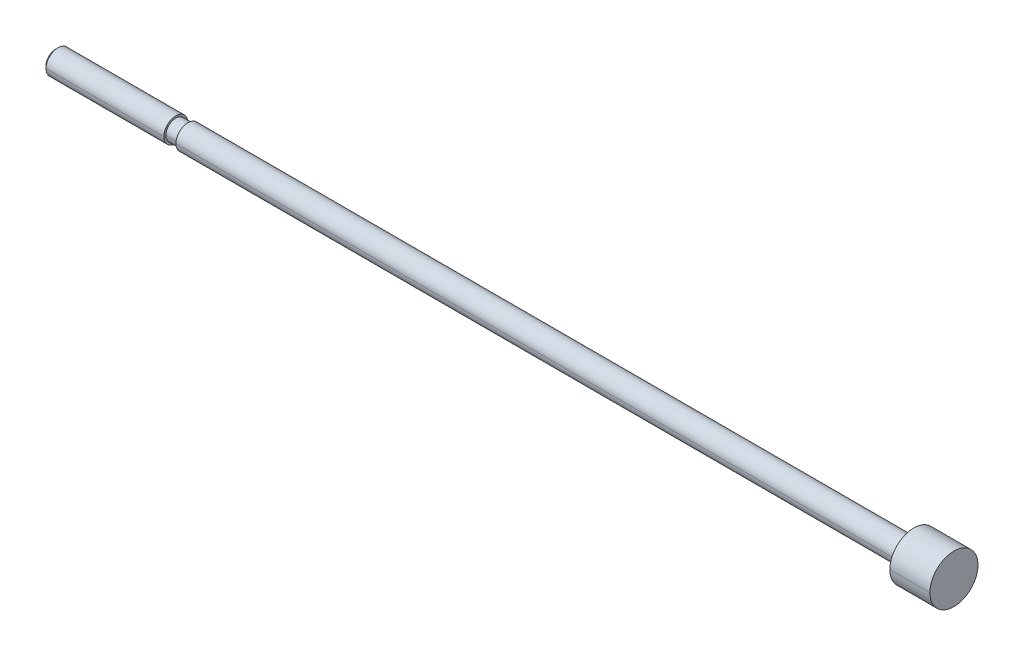
ISO-10303-21;
HEADER;
FILE_DESCRIPTION(('STEP AP214'),'2;1');
FILE_NAME('part.step','',(''),(''),'','','');
FILE_SCHEMA(('AUTOMOTIVE_DESIGN { 1 0 10303 214 1 1 1 1 }'));
ENDSEC;
DATA;
#1=APPLICATION_CONTEXT('core data for automotive mechanical design processes');
#2=APPLICATION_PROTOCOL_DEFINITION('international standard','automotive_design',2000,#1);
#3=PRODUCT_CONTEXT('',#1,'mechanical');
#4=PRODUCT('Part','Part','',(#3));
#5=PRODUCT_RELATED_PRODUCT_CATEGORY('part','',(#4));
#6=PRODUCT_DEFINITION_FORMATION('','',#4);
#7=PRODUCT_DEFINITION_CONTEXT('part definition',#1,'design');
#8=PRODUCT_DEFINITION('design','',#6,#7);
#9=PRODUCT_DEFINITION_SHAPE('','',#8);
#10=(LENGTH_UNIT() NAMED_UNIT(*) SI_UNIT(.MILLI.,.METRE.));
#11=(NAMED_UNIT(*) PLANE_ANGLE_UNIT() SI_UNIT($,.RADIAN.));
#12=(NAMED_UNIT(*) SI_UNIT($,.STERADIAN.) SOLID_ANGLE_UNIT());
#13=UNCERTAINTY_MEASURE_WITH_UNIT(LENGTH_MEASURE(1.E-05),#10,'distance_accuracy_value','');
#14=(GEOMETRIC_REPRESENTATION_CONTEXT(3) GLOBAL_UNCERTAINTY_ASSIGNED_CONTEXT((#13)) GLOBAL_UNIT_ASSIGNED_CONTEXT((#10,
#11,#12)) REPRESENTATION_CONTEXT('',''));
#15=CARTESIAN_POINT('',(0.,0.,0.));
#16=DIRECTION('',(0.,0.,1.));
#17=DIRECTION('',(1.,0.,0.));
#18=AXIS2_PLACEMENT_3D('',#15,#16,#17);
#19=CARTESIAN_POINT('',(112.,0.,0.));
#20=DIRECTION('',(-1.,0.,0.));
#21=DIRECTION('',(0.,-1.,0.));
#22=AXIS2_PLACEMENT_3D('',#19,#20,#21);
#23=CYLINDRICAL_SURFACE('',#22,3.);
#24=CARTESIAN_POINT('',(112.,0.,0.));
#25=DIRECTION('',(1.,0.,0.));
#26=DIRECTION('',(0.,0.,-1.));
#27=AXIS2_PLACEMENT_3D('',#24,#25,#26);
#28=CIRCLE('',#27,3.);
#29=CARTESIAN_POINT('',(112.,0.,-3.));
#30=VERTEX_POINT('',#29);
#31=CARTESIAN_POINT('',(112.,0.,3.));
#32=VERTEX_POINT('',#31);
#33=EDGE_CURVE('E11',#30,#32,#28,.T.);
#34=ORIENTED_EDGE('',*,*,#33,.F.);
#35=DIRECTION('',(-1.,0.,0.));
#36=VECTOR('',#35,1.);
#37=CARTESIAN_POINT('',(112.,0.,-3.));
#38=LINE('',#37,#36);
#39=CARTESIAN_POINT('',(107.,0.,-3.));
#40=VERTEX_POINT('',#39);
#41=EDGE_CURVE('E25',#30,#40,#38,.T.);
#42=ORIENTED_EDGE('',*,*,#41,.T.);
#43=CARTESIAN_POINT('',(107.,0.,0.));
#44=DIRECTION('',(1.,0.,0.));
#45=DIRECTION('',(0.,0.,-1.));
#46=AXIS2_PLACEMENT_3D('',#43,#44,#45);
#47=CIRCLE('',#46,3.);
#48=CARTESIAN_POINT('',(107.,0.,3.));
#49=VERTEX_POINT('',#48);
#50=EDGE_CURVE('E201',#40,#49,#47,.T.);
#51=ORIENTED_EDGE('',*,*,#50,.T.);
#52=DIRECTION('',(-1.,0.,0.));
#53=VECTOR('',#52,1.);
#54=CARTESIAN_POINT('',(112.,0.,3.));
#55=LINE('',#54,#53);
#56=EDGE_CURVE('E196',#32,#49,#55,.T.);
#57=ORIENTED_EDGE('',*,*,#56,.F.);
#58=EDGE_LOOP('',(#34,#42,#51,#57));
#59=FACE_BOUND('',#58,.T.);
#60=ADVANCED_FACE('F17',(#59),#23,.T.);
#61=CARTESIAN_POINT('',(112.,0.,0.));
#62=DIRECTION('',(-1.,0.,0.));
#63=DIRECTION('',(0.,1.,0.));
#64=AXIS2_PLACEMENT_3D('',#61,#62,#63);
#65=CYLINDRICAL_SURFACE('',#64,3.);
#66=CARTESIAN_POINT('',(107.,0.,0.));
#67=DIRECTION('',(1.,0.,0.));
#68=DIRECTION('',(0.,0.,-1.));
#69=AXIS2_PLACEMENT_3D('',#66,#67,#68);
#70=CIRCLE('',#69,3.);
#71=EDGE_CURVE('E192',#49,#40,#70,.T.);
#72=ORIENTED_EDGE('',*,*,#71,.T.);
#73=ORIENTED_EDGE('',*,*,#41,.F.);
#74=CARTESIAN_POINT('',(112.,0.,0.));
#75=DIRECTION('',(1.,0.,0.));
#76=DIRECTION('',(0.,0.,-1.));
#77=AXIS2_PLACEMENT_3D('',#74,#75,#76);
#78=CIRCLE('',#77,3.);
#79=EDGE_CURVE('E187',#32,#30,#78,.T.);
#80=ORIENTED_EDGE('',*,*,#79,.F.);
#81=ORIENTED_EDGE('',*,*,#56,.T.);
#82=EDGE_LOOP('',(#72,#73,#80,#81));
#83=FACE_BOUND('',#82,.T.);
#84=ADVANCED_FACE('F214',(#83),#65,.T.);
#85=CARTESIAN_POINT('',(112.,3.,0.));
#86=DIRECTION('',(-1.,0.,0.));
#87=DIRECTION('',(0.,0.,1.));
#88=AXIS2_PLACEMENT_3D('',#85,#86,#87);
#89=PLANE('',#88);
#90=ORIENTED_EDGE('',*,*,#33,.T.);
#91=ORIENTED_EDGE('',*,*,#79,.T.);
#92=EDGE_LOOP('',(#90,#91));
#93=FACE_BOUND('',#92,.T.);
#94=ADVANCED_FACE('F219',(#93),#89,.F.);
#95=CARTESIAN_POINT('',(107.,1.5,0.));
#96=DIRECTION('',(1.,0.,0.));
#97=DIRECTION('',(0.,0.,-1.));
#98=AXIS2_PLACEMENT_3D('',#95,#96,#97);
#99=PLANE('',#98);
#100=ORIENTED_EDGE('',*,*,#50,.F.);
#101=ORIENTED_EDGE('',*,*,#71,.F.);
#102=EDGE_LOOP('',(#100,#101));
#103=FACE_BOUND('',#102,.T.);
#104=CARTESIAN_POINT('',(107.,0.,0.));
#105=DIRECTION('',(1.,0.,0.));
#106=DIRECTION('',(0.,0.,-1.));
#107=AXIS2_PLACEMENT_3D('',#104,#105,#106);
#108=CIRCLE('',#107,1.5);
#109=CARTESIAN_POINT('',(107.,0.,-1.5));
#110=VERTEX_POINT('',#109);
#111=CARTESIAN_POINT('',(107.,0.,1.5));
#112=VERTEX_POINT('',#111);
#113=EDGE_CURVE('E183',#110,#112,#108,.T.);
#114=ORIENTED_EDGE('',*,*,#113,.T.);
#115=CARTESIAN_POINT('',(107.,0.,0.));
#116=DIRECTION('',(1.,0.,0.));
#117=DIRECTION('',(0.,0.,-1.));
#118=AXIS2_PLACEMENT_3D('',#115,#116,#117);
#119=CIRCLE('',#118,1.5);
#120=EDGE_CURVE('E179',#112,#110,#119,.T.);
#121=ORIENTED_EDGE('',*,*,#120,.T.);
#122=EDGE_LOOP('',(#114,#121));
#123=FACE_BOUND('',#122,.T.);
#124=ADVANCED_FACE('F215',(#103,#123),#99,.F.);
#125=CARTESIAN_POINT('',(112.,0.,0.));
#126=DIRECTION('',(-1.,0.,0.));
#127=DIRECTION('',(0.,1.,0.));
#128=AXIS2_PLACEMENT_3D('',#125,#126,#127);
#129=CYLINDRICAL_SURFACE('',#128,1.5);
#130=CARTESIAN_POINT('',(16.5,0.,0.));
#131=DIRECTION('',(1.,0.,0.));
#132=DIRECTION('',(0.,0.,-1.));
#133=AXIS2_PLACEMENT_3D('',#130,#131,#132);
#134=CIRCLE('',#133,1.5);
#135=CARTESIAN_POINT('',(16.5,0.,1.5));
#136=VERTEX_POINT('',#135);
#137=CARTESIAN_POINT('',(16.5,0.,-1.5));
#138=VERTEX_POINT('',#137);
#139=EDGE_CURVE('E175',#136,#138,#134,.T.);
#140=ORIENTED_EDGE('',*,*,#139,.T.);
#141=DIRECTION('',(-1.,0.,0.));
#142=VECTOR('',#141,1.);
#143=CARTESIAN_POINT('',(107.,0.,-1.5));
#144=LINE('',#143,#142);
#145=EDGE_CURVE('E170',#110,#138,#144,.T.);
#146=ORIENTED_EDGE('',*,*,#145,.F.);
#147=ORIENTED_EDGE('',*,*,#120,.F.);
#148=DIRECTION('',(-1.,0.,0.));
#149=VECTOR('',#148,1.);
#150=CARTESIAN_POINT('',(107.,0.,1.5));
#151=LINE('',#150,#149);
#152=EDGE_CURVE('E166',#112,#136,#151,.T.);
#153=ORIENTED_EDGE('',*,*,#152,.T.);
#154=EDGE_LOOP('',(#140,#146,#147,#153));
#155=FACE_BOUND('',#154,.T.);
#156=ADVANCED_FACE('F218',(#155),#129,.T.);
#157=CARTESIAN_POINT('',(112.,0.,0.));
#158=DIRECTION('',(-1.,0.,0.));
#159=DIRECTION('',(0.,-1.,0.));
#160=AXIS2_PLACEMENT_3D('',#157,#158,#159);
#161=CYLINDRICAL_SURFACE('',#160,1.5);
#162=ORIENTED_EDGE('',*,*,#113,.F.);
#163=ORIENTED_EDGE('',*,*,#145,.T.);
#164=CARTESIAN_POINT('',(16.5,0.,0.));
#165=DIRECTION('',(1.,0.,0.));
#166=DIRECTION('',(0.,0.,-1.));
#167=AXIS2_PLACEMENT_3D('',#164,#165,#166);
#168=CIRCLE('',#167,1.5);
#169=EDGE_CURVE('E161',#138,#136,#168,.T.);
#170=ORIENTED_EDGE('',*,*,#169,.T.);
#171=ORIENTED_EDGE('',*,*,#152,.F.);
#172=EDGE_LOOP('',(#162,#163,#170,#171));
#173=FACE_BOUND('',#172,.T.);
#174=ADVANCED_FACE('F227',(#173),#161,.T.);
#175=CARTESIAN_POINT('',(16.5,1.25,0.));
#176=DIRECTION('',(1.,0.,0.));
#177=DIRECTION('',(0.,0.,-1.));
#178=AXIS2_PLACEMENT_3D('',#175,#176,#177);
#179=PLANE('',#178);
#180=ORIENTED_EDGE('',*,*,#169,.F.);
#181=ORIENTED_EDGE('',*,*,#139,.F.);
#182=EDGE_LOOP('',(#180,#181));
#183=FACE_BOUND('',#182,.T.);
#184=CARTESIAN_POINT('',(16.5,0.,0.));
#185=DIRECTION('',(1.,0.,0.));
#186=DIRECTION('',(0.,0.,-1.));
#187=AXIS2_PLACEMENT_3D('',#184,#185,#186);
#188=CIRCLE('',#187,1.25);
#189=CARTESIAN_POINT('',(16.5,0.,-1.25));
#190=VERTEX_POINT('',#189);
#191=CARTESIAN_POINT('',(16.5,0.,1.25));
#192=VERTEX_POINT('',#191);
#193=EDGE_CURVE('E157',#190,#192,#188,.T.);
#194=ORIENTED_EDGE('',*,*,#193,.T.);
#195=CARTESIAN_POINT('',(16.5,0.,0.));
#196=DIRECTION('',(1.,0.,0.));
#197=DIRECTION('',(0.,0.,-1.));
#198=AXIS2_PLACEMENT_3D('',#195,#196,#197);
#199=CIRCLE('',#198,1.25);
#200=EDGE_CURVE('E153',#192,#190,#199,.T.);
#201=ORIENTED_EDGE('',*,*,#200,.T.);
#202=EDGE_LOOP('',(#194,#201));
#203=FACE_BOUND('',#202,.T.);
#204=ADVANCED_FACE('F231',(#183,#203),#179,.F.);
#205=CARTESIAN_POINT('',(112.,0.,0.));
#206=DIRECTION('',(-1.,0.,0.));
#207=DIRECTION('',(0.,1.,0.));
#208=AXIS2_PLACEMENT_3D('',#205,#206,#207);
#209=CYLINDRICAL_SURFACE('',#208,1.25);
#210=CARTESIAN_POINT('',(15.,0.,0.));
#211=DIRECTION('',(1.,0.,0.));
#212=DIRECTION('',(0.,0.,-1.));
#213=AXIS2_PLACEMENT_3D('',#210,#211,#212);
#214=CIRCLE('',#213,1.25);
#215=CARTESIAN_POINT('',(15.,0.,1.25));
#216=VERTEX_POINT('',#215);
#217=CARTESIAN_POINT('',(15.,0.,-1.25));
#218=VERTEX_POINT('',#217);
#219=EDGE_CURVE('E149',#216,#218,#214,.T.);
#220=ORIENTED_EDGE('',*,*,#219,.T.);
#221=DIRECTION('',(-1.,0.,0.));
#222=VECTOR('',#221,1.);
#223=CARTESIAN_POINT('',(16.5,0.,-1.25));
#224=LINE('',#223,#222);
#225=EDGE_CURVE('E144',#190,#218,#224,.T.);
#226=ORIENTED_EDGE('',*,*,#225,.F.);
#227=ORIENTED_EDGE('',*,*,#200,.F.);
#228=DIRECTION('',(-1.,0.,0.));
#229=VECTOR('',#228,1.);
#230=CARTESIAN_POINT('',(16.5,0.,1.25));
#231=LINE('',#230,#229);
#232=EDGE_CURVE('E140',#192,#216,#231,.T.);
#233=ORIENTED_EDGE('',*,*,#232,.T.);
#234=EDGE_LOOP('',(#220,#226,#227,#233));
#235=FACE_BOUND('',#234,.T.);
#236=ADVANCED_FACE('F234',(#235),#209,.T.);
#237=CARTESIAN_POINT('',(112.,0.,0.));
#238=DIRECTION('',(-1.,0.,0.));
#239=DIRECTION('',(0.,-1.,0.));
#240=AXIS2_PLACEMENT_3D('',#237,#238,#239);
#241=CYLINDRICAL_SURFACE('',#240,1.25);
#242=ORIENTED_EDGE('',*,*,#193,.F.);
#243=ORIENTED_EDGE('',*,*,#225,.T.);
#244=CARTESIAN_POINT('',(15.,0.,0.));
#245=DIRECTION('',(1.,0.,0.));
#246=DIRECTION('',(0.,0.,-1.));
#247=AXIS2_PLACEMENT_3D('',#244,#245,#246);
#248=CIRCLE('',#247,1.25);
#249=EDGE_CURVE('E135',#218,#216,#248,.T.);
#250=ORIENTED_EDGE('',*,*,#249,.T.);
#251=ORIENTED_EDGE('',*,*,#232,.F.);
#252=EDGE_LOOP('',(#242,#243,#250,#251));
#253=FACE_BOUND('',#252,.T.);
#254=ADVANCED_FACE('F242',(#253),#241,.T.);
#255=CARTESIAN_POINT('',(15.,1.5,0.));
#256=DIRECTION('',(-1.,0.,0.));
#257=DIRECTION('',(0.,0.,1.));
#258=AXIS2_PLACEMENT_3D('',#255,#256,#257);
#259=PLANE('',#258);
#260=ORIENTED_EDGE('',*,*,#249,.F.);
#261=ORIENTED_EDGE('',*,*,#219,.F.);
#262=EDGE_LOOP('',(#260,#261));
#263=FACE_BOUND('',#262,.T.);
#264=CARTESIAN_POINT('',(15.,0.,0.));
#265=DIRECTION('',(1.,0.,0.));
#266=DIRECTION('',(0.,0.,-1.));
#267=AXIS2_PLACEMENT_3D('',#264,#265,#266);
#268=CIRCLE('',#267,1.5);
#269=CARTESIAN_POINT('',(15.,0.,-1.5));
#270=VERTEX_POINT('',#269);
#271=CARTESIAN_POINT('',(15.,0.,1.5));
#272=VERTEX_POINT('',#271);
#273=EDGE_CURVE('E131',#270,#272,#268,.T.);
#274=ORIENTED_EDGE('',*,*,#273,.T.);
#275=CARTESIAN_POINT('',(15.,0.,0.));
#276=DIRECTION('',(1.,0.,0.));
#277=DIRECTION('',(0.,0.,-1.));
#278=AXIS2_PLACEMENT_3D('',#275,#276,#277);
#279=CIRCLE('',#278,1.5);
#280=EDGE_CURVE('E127',#272,#270,#279,.T.);
#281=ORIENTED_EDGE('',*,*,#280,.T.);
#282=EDGE_LOOP('',(#274,#281));
#283=FACE_BOUND('',#282,.T.);
#284=ADVANCED_FACE('F246',(#263,#283),#259,.F.);
#285=CARTESIAN_POINT('',(112.,0.,0.));
#286=DIRECTION('',(-1.,0.,0.));
#287=DIRECTION('',(0.,1.,0.));
#288=AXIS2_PLACEMENT_3D('',#285,#286,#287);
#289=CYLINDRICAL_SURFACE('',#288,1.5);
#290=CARTESIAN_POINT('',(0.306500000000001,0.,0.));
#291=DIRECTION('',(1.,0.,0.));
#292=DIRECTION('',(0.,0.,-1.));
#293=AXIS2_PLACEMENT_3D('',#290,#291,#292);
#294=CIRCLE('',#293,1.5);
#295=CARTESIAN_POINT('',(0.3065,0.,1.5));
#296=VERTEX_POINT('',#295);
#297=CARTESIAN_POINT('',(0.306500000000001,0.,-1.5));
#298=VERTEX_POINT('',#297);
#299=EDGE_CURVE('E98',#296,#298,#294,.T.);
#300=ORIENTED_EDGE('',*,*,#299,.T.);
#301=DIRECTION('',(-1.,0.,0.));
#302=VECTOR('',#301,1.);
#303=CARTESIAN_POINT('',(15.,0.,-1.5));
#304=LINE('',#303,#302);
#305=EDGE_CURVE('E119',#270,#298,#304,.T.);
#306=ORIENTED_EDGE('',*,*,#305,.F.);
#307=ORIENTED_EDGE('',*,*,#280,.F.);
#308=DIRECTION('',(-1.,0.,0.));
#309=VECTOR('',#308,1.);
#310=CARTESIAN_POINT('',(15.,0.,1.5));
#311=LINE('',#310,#309);
#312=EDGE_CURVE('E115',#272,#296,#311,.T.);
#313=ORIENTED_EDGE('',*,*,#312,.T.);
#314=EDGE_LOOP('',(#300,#306,#307,#313));
#315=FACE_BOUND('',#314,.T.);
#316=ADVANCED_FACE('F249',(#315),#289,.T.);
#317=CARTESIAN_POINT('',(112.,0.,0.));
#318=DIRECTION('',(-1.,0.,0.));
#319=DIRECTION('',(0.,-1.,0.));
#320=AXIS2_PLACEMENT_3D('',#317,#318,#319);
#321=CYLINDRICAL_SURFACE('',#320,1.5);
#322=ORIENTED_EDGE('',*,*,#273,.F.);
#323=ORIENTED_EDGE('',*,*,#305,.T.);
#324=CARTESIAN_POINT('',(0.306500000000001,0.,0.));
#325=DIRECTION('',(1.,0.,0.));
#326=DIRECTION('',(0.,0.,-1.));
#327=AXIS2_PLACEMENT_3D('',#324,#325,#326);
#328=CIRCLE('',#327,1.5);
#329=EDGE_CURVE('E110',#298,#296,#328,.T.);
#330=ORIENTED_EDGE('',*,*,#329,.T.);
#331=ORIENTED_EDGE('',*,*,#312,.F.);
#332=EDGE_LOOP('',(#322,#323,#330,#331));
#333=FACE_BOUND('',#332,.T.);
#334=ADVANCED_FACE('F257',(#333),#321,.T.);
#335=CARTESIAN_POINT('',(0.,0.,0.));
#336=DIRECTION('',(1.,0.,0.));
#337=DIRECTION('',(0.,-1.,0.));
#338=AXIS2_PLACEMENT_3D('',#335,#336,#337);
#339=CONICAL_SURFACE('',#338,1.1935,0.7853981634);
#340=ORIENTED_EDGE('',*,*,#329,.F.);
#341=DIRECTION('',(0.707106781184743,0.,-0.707106781188352));
#342=VECTOR('',#341,1.);
#343=CARTESIAN_POINT('',(0.,0.,-1.1935));
#344=LINE('',#343,#342);
#345=CARTESIAN_POINT('',(0.,0.,-1.1935));
#346=VERTEX_POINT('',#345);
#347=EDGE_CURVE('E90',#346,#298,#344,.T.);
#348=ORIENTED_EDGE('',*,*,#347,.F.);
#349=CARTESIAN_POINT('',(0.,0.,0.));
#350=DIRECTION('',(1.,0.,0.));
#351=DIRECTION('',(0.,0.,-1.));
#352=AXIS2_PLACEMENT_3D('',#349,#350,#351);
#353=CIRCLE('',#352,1.1935);
#354=CARTESIAN_POINT('',(0.,0.,1.1935));
#355=VERTEX_POINT('',#354);
#356=EDGE_CURVE('E83',#346,#355,#353,.T.);
#357=ORIENTED_EDGE('',*,*,#356,.T.);
#358=DIRECTION('',(0.707106781184743,0.,0.707106781188352));
#359=VECTOR('',#358,1.);
#360=CARTESIAN_POINT('',(0.,0.,1.1935));
#361=LINE('',#360,#359);
#362=EDGE_CURVE('E87',#355,#296,#361,.T.);
#363=ORIENTED_EDGE('',*,*,#362,.T.);
#364=EDGE_LOOP('',(#340,#348,#357,#363));
#365=FACE_BOUND('',#364,.T.);
#366=ADVANCED_FACE('F86',(#365),#339,.T.);
#367=CARTESIAN_POINT('',(0.,0.,0.));
#368=DIRECTION('',(1.,0.,0.));
#369=DIRECTION('',(0.,1.,0.));
#370=AXIS2_PLACEMENT_3D('',#367,#368,#369);
#371=CONICAL_SURFACE('',#370,1.1935,0.7853981634);
#372=CARTESIAN_POINT('',(0.,0.,0.));
#373=DIRECTION('',(1.,0.,0.));
#374=DIRECTION('',(0.,0.,-1.));
#375=AXIS2_PLACEMENT_3D('',#372,#373,#374);
#376=CIRCLE('',#375,1.1935);
#377=EDGE_CURVE('E97',#355,#346,#376,.T.);
#378=ORIENTED_EDGE('',*,*,#377,.T.);
#379=ORIENTED_EDGE('',*,*,#347,.T.);
#380=ORIENTED_EDGE('',*,*,#299,.F.);
#381=ORIENTED_EDGE('',*,*,#362,.F.);
#382=EDGE_LOOP('',(#378,#379,#380,#381));
#383=FACE_BOUND('',#382,.T.);
#384=ADVANCED_FACE('F96',(#383),#371,.T.);
#385=CARTESIAN_POINT('',(0.,0.,0.));
#386=DIRECTION('',(1.,0.,0.));
#387=DIRECTION('',(0.,0.,-1.));
#388=AXIS2_PLACEMENT_3D('',#385,#386,#387);
#389=PLANE('',#388);
#390=ORIENTED_EDGE('',*,*,#356,.F.);
#391=ORIENTED_EDGE('',*,*,#377,.F.);
#392=EDGE_LOOP('',(#390,#391));
#393=FACE_BOUND('',#392,.T.);
#394=ADVANCED_FACE('F100',(#393),#389,.F.);
#395=CLOSED_SHELL('',(#60,#84,#94,#124,#156,#174,#204,#236,#254,#284,#316,#334,#366,#384,#394));
#396=MANIFOLD_SOLID_BREP('B1',#395);
#397=ADVANCED_BREP_SHAPE_REPRESENTATION('',(#18,#396),#14);
#398=SHAPE_DEFINITION_REPRESENTATION(#9,#397);
ENDSEC;
END-ISO-10303-21;
